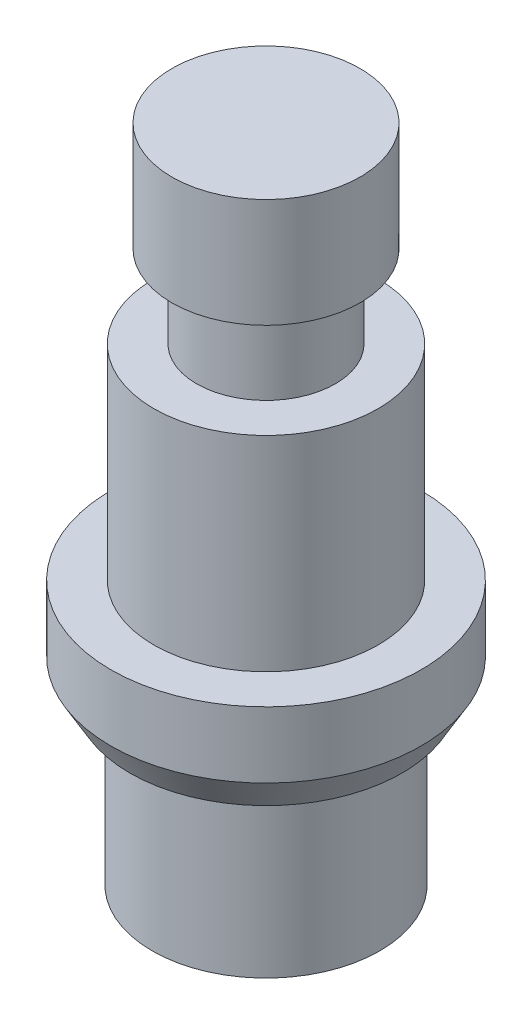
ISO-10303-21;
HEADER;
FILE_DESCRIPTION(('STEP AP214'),'2;1');
FILE_NAME('part.step','',(''),(''),'','','');
FILE_SCHEMA(('AUTOMOTIVE_DESIGN { 1 0 10303 214 1 1 1 1 }'));
ENDSEC;
DATA;
#1=APPLICATION_CONTEXT('core data for automotive mechanical design processes');
#2=APPLICATION_PROTOCOL_DEFINITION('international standard','automotive_design',2000,#1);
#3=PRODUCT_CONTEXT('',#1,'mechanical');
#4=PRODUCT('Part','Part','',(#3));
#5=PRODUCT_RELATED_PRODUCT_CATEGORY('part','',(#4));
#6=PRODUCT_DEFINITION_FORMATION('','',#4);
#7=PRODUCT_DEFINITION_CONTEXT('part definition',#1,'design');
#8=PRODUCT_DEFINITION('design','',#6,#7);
#9=PRODUCT_DEFINITION_SHAPE('','',#8);
#10=(LENGTH_UNIT() NAMED_UNIT(*) SI_UNIT(.MILLI.,.METRE.));
#11=(NAMED_UNIT(*) PLANE_ANGLE_UNIT() SI_UNIT($,.RADIAN.));
#12=(NAMED_UNIT(*) SI_UNIT($,.STERADIAN.) SOLID_ANGLE_UNIT());
#13=UNCERTAINTY_MEASURE_WITH_UNIT(LENGTH_MEASURE(1.E-05),#10,'distance_accuracy_value','');
#14=(GEOMETRIC_REPRESENTATION_CONTEXT(3) GLOBAL_UNCERTAINTY_ASSIGNED_CONTEXT((#13)) GLOBAL_UNIT_ASSIGNED_CONTEXT((#10,
#11,#12)) REPRESENTATION_CONTEXT('',''));
#15=CARTESIAN_POINT('',(0.,0.,0.));
#16=DIRECTION('',(0.,0.,1.));
#17=DIRECTION('',(1.,0.,0.));
#18=AXIS2_PLACEMENT_3D('',#15,#16,#17);
#19=CARTESIAN_POINT('',(0.,8.,0.));
#20=DIRECTION('',(0.,1.,0.));
#21=DIRECTION('',(0.,0.,1.));
#22=AXIS2_PLACEMENT_3D('',#19,#20,#21);
#23=CYLINDRICAL_SURFACE('',#22,3.4);
#24=CARTESIAN_POINT('',(0.,8.,0.));
#25=DIRECTION('',(0.,1.,0.));
#26=DIRECTION('',(0.,0.,1.));
#27=AXIS2_PLACEMENT_3D('',#24,#25,#26);
#28=CIRCLE('',#27,3.4);
#29=CARTESIAN_POINT('',(0.,8.,3.4));
#30=VERTEX_POINT('',#29);
#31=EDGE_CURVE('E63',#30,#30,#28,.T.);
#32=ORIENTED_EDGE('',*,*,#31,.T.);
#33=EDGE_LOOP('',(#32));
#34=FACE_BOUND('',#33,.T.);
#35=CARTESIAN_POINT('',(0.,14.2,0.));
#36=DIRECTION('',(0.,1.,0.));
#37=DIRECTION('',(0.,0.,1.));
#38=AXIS2_PLACEMENT_3D('',#35,#36,#37);
#39=CIRCLE('',#38,3.4);
#40=CARTESIAN_POINT('',(0.,14.2,3.4));
#41=VERTEX_POINT('',#40);
#42=EDGE_CURVE('E55',#41,#41,#39,.F.);
#43=ORIENTED_EDGE('',*,*,#42,.T.);
#44=EDGE_LOOP('',(#43));
#45=FACE_BOUND('',#44,.T.);
#46=ADVANCED_FACE('F37',(#34,#45),#23,.T.);
#47=CARTESIAN_POINT('',(0.,20.,0.));
#48=DIRECTION('',(0.,-1.,0.));
#49=DIRECTION('',(0.,0.,-1.));
#50=AXIS2_PLACEMENT_3D('',#47,#48,#49);
#51=CYLINDRICAL_SURFACE('',#50,4.7);
#52=CARTESIAN_POINT('',(0.,6.00000000000001,0.));
#53=DIRECTION('',(0.,-1.,0.));
#54=DIRECTION('',(0.,0.,-1.));
#55=AXIS2_PLACEMENT_3D('',#52,#53,#54);
#56=CIRCLE('',#55,4.7);
#57=CARTESIAN_POINT('',(0.,6.00000000000001,-4.7));
#58=VERTEX_POINT('',#57);
#59=EDGE_CURVE('E11',#58,#58,#56,.F.);
#60=ORIENTED_EDGE('',*,*,#59,.T.);
#61=EDGE_LOOP('',(#60));
#62=FACE_BOUND('',#61,.T.);
#63=CARTESIAN_POINT('',(0.,8.,0.));
#64=DIRECTION('',(0.,1.,0.));
#65=DIRECTION('',(0.,0.,1.));
#66=AXIS2_PLACEMENT_3D('',#63,#64,#65);
#67=CIRCLE('',#66,4.7);
#68=CARTESIAN_POINT('',(0.,8.,4.7));
#69=VERTEX_POINT('',#68);
#70=EDGE_CURVE('E60',#69,#69,#67,.T.);
#71=ORIENTED_EDGE('',*,*,#70,.F.);
#72=EDGE_LOOP('',(#71));
#73=FACE_BOUND('',#72,.T.);
#74=ADVANCED_FACE('F100',(#62,#73),#51,.T.);
#75=CARTESIAN_POINT('',(0.,5.,0.));
#76=DIRECTION('',(0.,-1.,0.));
#77=DIRECTION('',(0.,0.,-1.));
#78=AXIS2_PLACEMENT_3D('',#75,#76,#77);
#79=PLANE('',#78);
#80=CARTESIAN_POINT('',(0.,5.,0.));
#81=DIRECTION('',(0.,-1.,0.));
#82=DIRECTION('',(0.,0.,-1.));
#83=AXIS2_PLACEMENT_3D('',#80,#81,#82);
#84=CIRCLE('',#83,4.12264973081037);
#85=CARTESIAN_POINT('',(0.,5.,-4.12264973081037));
#86=VERTEX_POINT('',#85);
#87=EDGE_CURVE('E44',#86,#86,#84,.T.);
#88=ORIENTED_EDGE('',*,*,#87,.T.);
#89=EDGE_LOOP('',(#88));
#90=FACE_BOUND('',#89,.T.);
#91=CARTESIAN_POINT('',(0.,5.,0.));
#92=DIRECTION('',(0.,-1.,0.));
#93=DIRECTION('',(0.,0.,-1.));
#94=AXIS2_PLACEMENT_3D('',#91,#92,#93);
#95=CIRCLE('',#94,3.45);
#96=CARTESIAN_POINT('',(0.,5.,-3.45));
#97=VERTEX_POINT('',#96);
#98=EDGE_CURVE('E48',#97,#97,#95,.T.);
#99=ORIENTED_EDGE('',*,*,#98,.F.);
#100=EDGE_LOOP('',(#99));
#101=FACE_BOUND('',#100,.T.);
#102=ADVANCED_FACE('F107',(#90,#101),#79,.T.);
#103=CARTESIAN_POINT('',(0.,5.,0.));
#104=DIRECTION('',(0.,-1.,0.));
#105=DIRECTION('',(0.,0.,-1.));
#106=AXIS2_PLACEMENT_3D('',#103,#104,#105);
#107=CYLINDRICAL_SURFACE('',#106,3.45);
#108=ORIENTED_EDGE('',*,*,#98,.T.);
#109=EDGE_LOOP('',(#108));
#110=FACE_BOUND('',#109,.T.);
#111=CARTESIAN_POINT('',(0.,0.,0.));
#112=DIRECTION('',(0.,-1.,0.));
#113=DIRECTION('',(0.,0.,-1.));
#114=AXIS2_PLACEMENT_3D('',#111,#112,#113);
#115=CIRCLE('',#114,3.45);
#116=CARTESIAN_POINT('',(0.,0.,-3.45));
#117=VERTEX_POINT('',#116);
#118=EDGE_CURVE('E52',#117,#117,#115,.T.);
#119=ORIENTED_EDGE('',*,*,#118,.F.);
#120=EDGE_LOOP('',(#119));
#121=FACE_BOUND('',#120,.T.);
#122=ADVANCED_FACE('F112',(#110,#121),#107,.T.);
#123=CARTESIAN_POINT('',(0.,0.,0.));
#124=DIRECTION('',(0.,1.,0.));
#125=DIRECTION('',(0.,0.,1.));
#126=AXIS2_PLACEMENT_3D('',#123,#124,#125);
#127=PLANE('',#126);
#128=ORIENTED_EDGE('',*,*,#118,.T.);
#129=EDGE_LOOP('',(#128));
#130=FACE_BOUND('',#129,.T.);
#131=ADVANCED_FACE('F94',(#130),#127,.F.);
#132=CARTESIAN_POINT('',(0.,8.,0.));
#133=DIRECTION('',(0.,1.,0.));
#134=DIRECTION('',(0.,0.,1.));
#135=AXIS2_PLACEMENT_3D('',#132,#133,#134);
#136=PLANE('',#135);
#137=ORIENTED_EDGE('',*,*,#31,.F.);
#138=EDGE_LOOP('',(#137));
#139=FACE_BOUND('',#138,.T.);
#140=ORIENTED_EDGE('',*,*,#70,.T.);
#141=EDGE_LOOP('',(#140));
#142=FACE_BOUND('',#141,.T.);
#143=ADVANCED_FACE('F85',(#139,#142),#136,.T.);
#144=CARTESIAN_POINT('',(0.,14.2,0.));
#145=DIRECTION('',(0.,1.,0.));
#146=DIRECTION('',(0.,0.,1.));
#147=AXIS2_PLACEMENT_3D('',#144,#145,#146);
#148=PLANE('',#147);
#149=ORIENTED_EDGE('',*,*,#42,.F.);
#150=EDGE_LOOP('',(#149));
#151=FACE_BOUND('',#150,.T.);
#152=CARTESIAN_POINT('',(0.,14.2,0.));
#153=DIRECTION('',(0.,1.,0.));
#154=DIRECTION('',(0.,0.,1.));
#155=AXIS2_PLACEMENT_3D('',#152,#153,#154);
#156=CIRCLE('',#155,2.1);
#157=CARTESIAN_POINT('',(0.,14.2,2.1));
#158=VERTEX_POINT('',#157);
#159=EDGE_CURVE('E72',#158,#158,#156,.T.);
#160=ORIENTED_EDGE('',*,*,#159,.F.);
#161=EDGE_LOOP('',(#160));
#162=FACE_BOUND('',#161,.T.);
#163=ADVANCED_FACE('F82',(#151,#162),#148,.T.);
#164=CARTESIAN_POINT('',(0.,16.7,0.));
#165=DIRECTION('',(0.,1.,0.));
#166=DIRECTION('',(0.,0.,1.));
#167=AXIS2_PLACEMENT_3D('',#164,#165,#166);
#168=PLANE('',#167);
#169=CARTESIAN_POINT('',(0.,16.7,0.));
#170=DIRECTION('',(0.,1.,0.));
#171=DIRECTION('',(0.,0.,1.));
#172=AXIS2_PLACEMENT_3D('',#169,#170,#171);
#173=CIRCLE('',#172,2.85);
#174=CARTESIAN_POINT('',(0.,16.7,2.85));
#175=VERTEX_POINT('',#174);
#176=EDGE_CURVE('E59',#175,#175,#173,.F.);
#177=ORIENTED_EDGE('',*,*,#176,.T.);
#178=EDGE_LOOP('',(#177));
#179=FACE_BOUND('',#178,.T.);
#180=CARTESIAN_POINT('',(0.,16.7,0.));
#181=DIRECTION('',(0.,1.,0.));
#182=DIRECTION('',(0.,0.,1.));
#183=AXIS2_PLACEMENT_3D('',#180,#181,#182);
#184=CIRCLE('',#183,2.1);
#185=CARTESIAN_POINT('',(0.,16.7,2.1));
#186=VERTEX_POINT('',#185);
#187=EDGE_CURVE('E73',#186,#186,#184,.T.);
#188=ORIENTED_EDGE('',*,*,#187,.T.);
#189=EDGE_LOOP('',(#188));
#190=FACE_BOUND('',#189,.T.);
#191=ADVANCED_FACE('F84',(#179,#190),#168,.F.);
#192=CARTESIAN_POINT('',(0.,14.2,0.));
#193=DIRECTION('',(0.,1.,0.));
#194=DIRECTION('',(0.,0.,1.));
#195=AXIS2_PLACEMENT_3D('',#192,#193,#194);
#196=CYLINDRICAL_SURFACE('',#195,2.1);
#197=ORIENTED_EDGE('',*,*,#159,.T.);
#198=EDGE_LOOP('',(#197));
#199=FACE_BOUND('',#198,.T.);
#200=ORIENTED_EDGE('',*,*,#187,.F.);
#201=EDGE_LOOP('',(#200));
#202=FACE_BOUND('',#201,.T.);
#203=ADVANCED_FACE('F79',(#199,#202),#196,.T.);
#204=CARTESIAN_POINT('',(0.,20.,0.));
#205=DIRECTION('',(0.,1.,0.));
#206=DIRECTION('',(0.,0.,1.));
#207=AXIS2_PLACEMENT_3D('',#204,#205,#206);
#208=PLANE('',#207);
#209=CARTESIAN_POINT('',(0.,20.,0.));
#210=DIRECTION('',(0.,1.,0.));
#211=DIRECTION('',(0.,0.,1.));
#212=AXIS2_PLACEMENT_3D('',#209,#210,#211);
#213=CIRCLE('',#212,2.85);
#214=CARTESIAN_POINT('',(0.,20.,2.85));
#215=VERTEX_POINT('',#214);
#216=EDGE_CURVE('E58',#215,#215,#213,.T.);
#217=ORIENTED_EDGE('',*,*,#216,.T.);
#218=EDGE_LOOP('',(#217));
#219=FACE_BOUND('',#218,.T.);
#220=ADVANCED_FACE('F118',(#219),#208,.T.);
#221=CARTESIAN_POINT('',(0.,16.7,0.));
#222=DIRECTION('',(0.,1.,0.));
#223=DIRECTION('',(0.,0.,1.));
#224=AXIS2_PLACEMENT_3D('',#221,#222,#223);
#225=CYLINDRICAL_SURFACE('',#224,2.85);
#226=ORIENTED_EDGE('',*,*,#176,.F.);
#227=EDGE_LOOP('',(#226));
#228=FACE_BOUND('',#227,.T.);
#229=ORIENTED_EDGE('',*,*,#216,.F.);
#230=EDGE_LOOP('',(#229));
#231=FACE_BOUND('',#230,.T.);
#232=ADVANCED_FACE('F110',(#228,#231),#225,.T.);
#233=CARTESIAN_POINT('',(0.,5.,0.));
#234=DIRECTION('',(0.,1.,0.));
#235=DIRECTION('',(0.,0.,1.));
#236=AXIS2_PLACEMENT_3D('',#233,#234,#235);
#237=CONICAL_SURFACE('',#236,4.12264973081037,0.523598775598298);
#238=ORIENTED_EDGE('',*,*,#59,.F.);
#239=EDGE_LOOP('',(#238));
#240=FACE_BOUND('',#239,.T.);
#241=ORIENTED_EDGE('',*,*,#87,.F.);
#242=EDGE_LOOP('',(#241));
#243=FACE_BOUND('',#242,.T.);
#244=ADVANCED_FACE('F39',(#240,#243),#237,.T.);
#245=CLOSED_SHELL('',(#46,#74,#102,#122,#131,#143,#163,#191,#203,#220,#232,#244));
#246=MANIFOLD_SOLID_BREP('B2',#245);
#247=ADVANCED_BREP_SHAPE_REPRESENTATION('',(#18,#246),#14);
#248=SHAPE_DEFINITION_REPRESENTATION(#9,#247);
ENDSEC;
END-ISO-10303-21;
